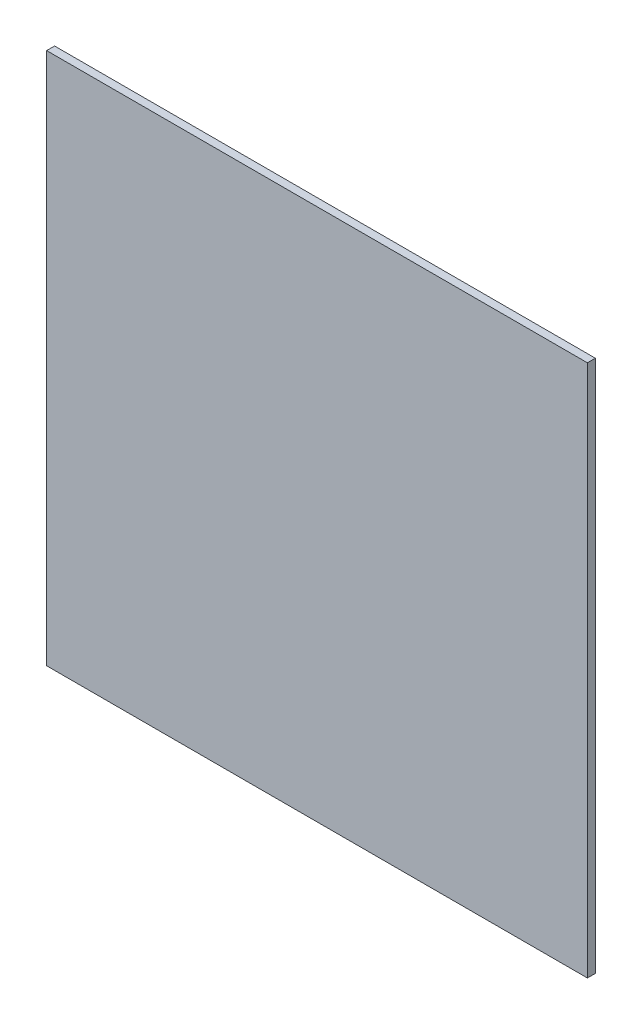
ISO-10303-21;
HEADER;
FILE_DESCRIPTION(('STEP AP214'),'2;1');
FILE_NAME('part.step','',(''),(''),'','','');
FILE_SCHEMA(('AUTOMOTIVE_DESIGN { 1 0 10303 214 1 1 1 1 }'));
ENDSEC;
DATA;
#1=APPLICATION_CONTEXT('core data for automotive mechanical design processes');
#2=APPLICATION_PROTOCOL_DEFINITION('international standard','automotive_design',2000,#1);
#3=PRODUCT_CONTEXT('',#1,'mechanical');
#4=PRODUCT('Part','Part','',(#3));
#5=PRODUCT_RELATED_PRODUCT_CATEGORY('part','',(#4));
#6=PRODUCT_DEFINITION_FORMATION('','',#4);
#7=PRODUCT_DEFINITION_CONTEXT('part definition',#1,'design');
#8=PRODUCT_DEFINITION('design','',#6,#7);
#9=PRODUCT_DEFINITION_SHAPE('','',#8);
#10=(LENGTH_UNIT() NAMED_UNIT(*) SI_UNIT(.MILLI.,.METRE.));
#11=(NAMED_UNIT(*) PLANE_ANGLE_UNIT() SI_UNIT($,.RADIAN.));
#12=(NAMED_UNIT(*) SI_UNIT($,.STERADIAN.) SOLID_ANGLE_UNIT());
#13=UNCERTAINTY_MEASURE_WITH_UNIT(LENGTH_MEASURE(1.E-05),#10,'distance_accuracy_value','');
#14=(GEOMETRIC_REPRESENTATION_CONTEXT(3) GLOBAL_UNCERTAINTY_ASSIGNED_CONTEXT((#13)) GLOBAL_UNIT_ASSIGNED_CONTEXT((#10,
#11,#12)) REPRESENTATION_CONTEXT('',''));
#15=CARTESIAN_POINT('',(0.,0.,0.));
#16=DIRECTION('',(0.,0.,1.));
#17=DIRECTION('',(1.,0.,0.));
#18=AXIS2_PLACEMENT_3D('',#15,#16,#17);
#19=CARTESIAN_POINT('',(-340.,335.,10.));
#20=DIRECTION('',(1.,0.,0.));
#21=DIRECTION('',(0.,1.,0.));
#22=AXIS2_PLACEMENT_3D('',#19,#20,#21);
#23=PLANE('',#22);
#24=DIRECTION('',(0.,-1.,0.));
#25=VECTOR('',#24,1.);
#26=CARTESIAN_POINT('',(-340.,335.,0.));
#27=LINE('',#26,#25);
#28=CARTESIAN_POINT('',(-340.,335.,0.));
#29=VERTEX_POINT('',#28);
#30=CARTESIAN_POINT('',(-340.,-335.,0.));
#31=VERTEX_POINT('',#30);
#32=EDGE_CURVE('E96',#29,#31,#27,.T.);
#33=ORIENTED_EDGE('',*,*,#32,.T.);
#34=DIRECTION('',(0.,0.,-1.));
#35=VECTOR('',#34,1.);
#36=CARTESIAN_POINT('',(-340.,-335.,10.));
#37=LINE('',#36,#35);
#38=CARTESIAN_POINT('',(-340.,-335.,10.));
#39=VERTEX_POINT('',#38);
#40=EDGE_CURVE('E11',#39,#31,#37,.T.);
#41=ORIENTED_EDGE('',*,*,#40,.F.);
#42=DIRECTION('',(0.,-1.,0.));
#43=VECTOR('',#42,1.);
#44=CARTESIAN_POINT('',(-340.,335.,10.));
#45=LINE('',#44,#43);
#46=CARTESIAN_POINT('',(-340.,335.,10.));
#47=VERTEX_POINT('',#46);
#48=EDGE_CURVE('E84',#47,#39,#45,.T.);
#49=ORIENTED_EDGE('',*,*,#48,.F.);
#50=DIRECTION('',(0.,0.,-1.));
#51=VECTOR('',#50,1.);
#52=CARTESIAN_POINT('',(-340.,335.,10.));
#53=LINE('',#52,#51);
#54=EDGE_CURVE('E92',#47,#29,#53,.T.);
#55=ORIENTED_EDGE('',*,*,#54,.T.);
#56=EDGE_LOOP('',(#33,#41,#49,#55));
#57=FACE_BOUND('',#56,.T.);
#58=ADVANCED_FACE('F33',(#57),#23,.F.);
#59=CARTESIAN_POINT('',(-340.,-335.,10.));
#60=DIRECTION('',(0.,1.,0.));
#61=DIRECTION('',(0.,0.,1.));
#62=AXIS2_PLACEMENT_3D('',#59,#60,#61);
#63=PLANE('',#62);
#64=DIRECTION('',(1.,0.,0.));
#65=VECTOR('',#64,1.);
#66=CARTESIAN_POINT('',(-340.,-335.,0.));
#67=LINE('',#66,#65);
#68=CARTESIAN_POINT('',(340.,-335.,0.));
#69=VERTEX_POINT('',#68);
#70=EDGE_CURVE('E88',#31,#69,#67,.T.);
#71=ORIENTED_EDGE('',*,*,#70,.T.);
#72=DIRECTION('',(0.,0.,-1.));
#73=VECTOR('',#72,1.);
#74=CARTESIAN_POINT('',(340.,-335.,10.));
#75=LINE('',#74,#73);
#76=CARTESIAN_POINT('',(340.,-335.,10.));
#77=VERTEX_POINT('',#76);
#78=EDGE_CURVE('E41',#77,#69,#75,.T.);
#79=ORIENTED_EDGE('',*,*,#78,.F.);
#80=DIRECTION('',(1.,0.,0.));
#81=VECTOR('',#80,1.);
#82=CARTESIAN_POINT('',(-340.,-335.,10.));
#83=LINE('',#82,#81);
#84=EDGE_CURVE('E79',#39,#77,#83,.T.);
#85=ORIENTED_EDGE('',*,*,#84,.F.);
#86=ORIENTED_EDGE('',*,*,#40,.T.);
#87=EDGE_LOOP('',(#71,#79,#85,#86));
#88=FACE_BOUND('',#87,.T.);
#89=ADVANCED_FACE('F87',(#88),#63,.F.);
#90=CARTESIAN_POINT('',(340.,335.,10.));
#91=DIRECTION('',(-1.,0.,0.));
#92=DIRECTION('',(0.,-1.,0.));
#93=AXIS2_PLACEMENT_3D('',#90,#91,#92);
#94=PLANE('',#93);
#95=DIRECTION('',(0.,1.,0.));
#96=VECTOR('',#95,1.);
#97=CARTESIAN_POINT('',(340.,335.,0.));
#98=LINE('',#97,#96);
#99=CARTESIAN_POINT('',(340.,335.,0.));
#100=VERTEX_POINT('',#99);
#101=EDGE_CURVE('E66',#69,#100,#98,.T.);
#102=ORIENTED_EDGE('',*,*,#101,.T.);
#103=DIRECTION('',(0.,0.,-1.));
#104=VECTOR('',#103,1.);
#105=CARTESIAN_POINT('',(340.,335.,10.));
#106=LINE('',#105,#104);
#107=CARTESIAN_POINT('',(340.,335.,10.));
#108=VERTEX_POINT('',#107);
#109=EDGE_CURVE('E89',#108,#100,#106,.T.);
#110=ORIENTED_EDGE('',*,*,#109,.F.);
#111=DIRECTION('',(0.,1.,0.));
#112=VECTOR('',#111,1.);
#113=CARTESIAN_POINT('',(340.,335.,10.));
#114=LINE('',#113,#112);
#115=EDGE_CURVE('E82',#77,#108,#114,.T.);
#116=ORIENTED_EDGE('',*,*,#115,.F.);
#117=ORIENTED_EDGE('',*,*,#78,.T.);
#118=EDGE_LOOP('',(#102,#110,#116,#117));
#119=FACE_BOUND('',#118,.T.);
#120=ADVANCED_FACE('F90',(#119),#94,.F.);
#121=CARTESIAN_POINT('',(-340.,335.,10.));
#122=DIRECTION('',(0.,-1.,0.));
#123=DIRECTION('',(1.,0.,0.));
#124=AXIS2_PLACEMENT_3D('',#121,#122,#123);
#125=PLANE('',#124);
#126=DIRECTION('',(-1.,0.,0.));
#127=VECTOR('',#126,1.);
#128=CARTESIAN_POINT('',(-340.,335.,0.));
#129=LINE('',#128,#127);
#130=EDGE_CURVE('E72',#100,#29,#129,.T.);
#131=ORIENTED_EDGE('',*,*,#130,.T.);
#132=ORIENTED_EDGE('',*,*,#54,.F.);
#133=DIRECTION('',(-1.,0.,0.));
#134=VECTOR('',#133,1.);
#135=CARTESIAN_POINT('',(-340.,335.,10.));
#136=LINE('',#135,#134);
#137=EDGE_CURVE('E49',#108,#47,#136,.T.);
#138=ORIENTED_EDGE('',*,*,#137,.F.);
#139=ORIENTED_EDGE('',*,*,#109,.T.);
#140=EDGE_LOOP('',(#131,#132,#138,#139));
#141=FACE_BOUND('',#140,.T.);
#142=ADVANCED_FACE('F103',(#141),#125,.F.);
#143=CARTESIAN_POINT('',(0.,0.,10.));
#144=DIRECTION('',(0.,0.,1.));
#145=DIRECTION('',(1.,0.,0.));
#146=AXIS2_PLACEMENT_3D('',#143,#144,#145);
#147=PLANE('',#146);
#148=ORIENTED_EDGE('',*,*,#48,.T.);
#149=ORIENTED_EDGE('',*,*,#84,.T.);
#150=ORIENTED_EDGE('',*,*,#115,.T.);
#151=ORIENTED_EDGE('',*,*,#137,.T.);
#152=EDGE_LOOP('',(#148,#149,#150,#151));
#153=FACE_BOUND('',#152,.T.);
#154=ADVANCED_FACE('F80',(#153),#147,.T.);
#155=CARTESIAN_POINT('',(0.,0.,0.));
#156=DIRECTION('',(0.,0.,1.));
#157=DIRECTION('',(1.,0.,0.));
#158=AXIS2_PLACEMENT_3D('',#155,#156,#157);
#159=PLANE('',#158);
#160=ORIENTED_EDGE('',*,*,#32,.F.);
#161=ORIENTED_EDGE('',*,*,#130,.F.);
#162=ORIENTED_EDGE('',*,*,#101,.F.);
#163=ORIENTED_EDGE('',*,*,#70,.F.);
#164=EDGE_LOOP('',(#160,#161,#162,#163));
#165=FACE_BOUND('',#164,.T.);
#166=ADVANCED_FACE('F106',(#165),#159,.F.);
#167=CLOSED_SHELL('',(#58,#89,#120,#142,#154,#166));
#168=MANIFOLD_SOLID_BREP('B2',#167);
#169=ADVANCED_BREP_SHAPE_REPRESENTATION('',(#18,#168),#14);
#170=SHAPE_DEFINITION_REPRESENTATION(#9,#169);
ENDSEC;
END-ISO-10303-21;
